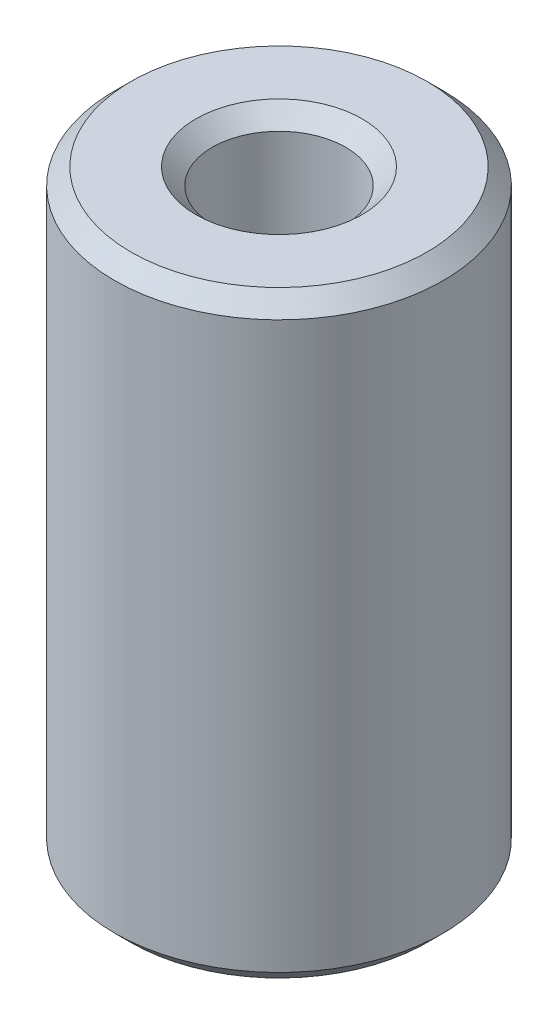
ISO-10303-21;
HEADER;
FILE_DESCRIPTION(('STEP AP214'),'2;1');
FILE_NAME('part.step','',(''),(''),'','','');
FILE_SCHEMA(('AUTOMOTIVE_DESIGN { 1 0 10303 214 1 1 1 1 }'));
ENDSEC;
DATA;
#1=APPLICATION_CONTEXT('core data for automotive mechanical design processes');
#2=APPLICATION_PROTOCOL_DEFINITION('international standard','automotive_design',2000,#1);
#3=PRODUCT_CONTEXT('',#1,'mechanical');
#4=PRODUCT('Part','Part','',(#3));
#5=PRODUCT_RELATED_PRODUCT_CATEGORY('part','',(#4));
#6=PRODUCT_DEFINITION_FORMATION('','',#4);
#7=PRODUCT_DEFINITION_CONTEXT('part definition',#1,'design');
#8=PRODUCT_DEFINITION('design','',#6,#7);
#9=PRODUCT_DEFINITION_SHAPE('','',#8);
#10=(LENGTH_UNIT() NAMED_UNIT(*) SI_UNIT(.MILLI.,.METRE.));
#11=(NAMED_UNIT(*) PLANE_ANGLE_UNIT() SI_UNIT($,.RADIAN.));
#12=(NAMED_UNIT(*) SI_UNIT($,.STERADIAN.) SOLID_ANGLE_UNIT());
#13=UNCERTAINTY_MEASURE_WITH_UNIT(LENGTH_MEASURE(1.E-05),#10,'distance_accuracy_value','');
#14=(GEOMETRIC_REPRESENTATION_CONTEXT(3) GLOBAL_UNCERTAINTY_ASSIGNED_CONTEXT((#13)) GLOBAL_UNIT_ASSIGNED_CONTEXT((#10,
#11,#12)) REPRESENTATION_CONTEXT('',''));
#15=CARTESIAN_POINT('',(0.,0.,0.));
#16=DIRECTION('',(0.,0.,1.));
#17=DIRECTION('',(1.,0.,0.));
#18=AXIS2_PLACEMENT_3D('',#15,#16,#17);
#19=CARTESIAN_POINT('',(0.,27.2912623590373,0.));
#20=DIRECTION('',(0.,-1.,0.));
#21=DIRECTION('',(0.,0.,-1.));
#22=AXIS2_PLACEMENT_3D('',#19,#20,#21);
#23=CYLINDRICAL_SURFACE('',#22,7.5);
#24=CARTESIAN_POINT('',(0.,0.748931803457614,0.));
#25=DIRECTION('',(0.,1.,0.));
#26=DIRECTION('',(0.,0.,1.));
#27=AXIS2_PLACEMENT_3D('',#24,#25,#26);
#28=CIRCLE('',#27,7.5);
#29=CARTESIAN_POINT('',(0.,0.748931803457611,-7.5));
#30=VERTEX_POINT('',#29);
#31=EDGE_CURVE('E10',#30,#30,#28,.T.);
#32=CARTESIAN_POINT('',(0.,26.5423305555798,0.));
#33=DIRECTION('',(0.,1.,0.));
#34=DIRECTION('',(0.,0.,1.));
#35=AXIS2_PLACEMENT_3D('',#32,#33,#34);
#36=CIRCLE('',#35,7.5);
#37=CARTESIAN_POINT('',(0.,26.5423305555798,-7.5));
#38=VERTEX_POINT('',#37);
#39=EDGE_CURVE('E50',#38,#38,#36,.F.);
#40=CARTESIAN_POINT('',(0.,0.748931803457611,-7.5));
#41=CARTESIAN_POINT('',(0.,1.01761304045888,-7.5));
#42=CARTESIAN_POINT('',(0.,1.28629427746016,-7.5));
#43=CARTESIAN_POINT('',(0.,1.8236567514627,-7.5));
#44=CARTESIAN_POINT('',(0.,2.09233798846397,-7.5));
#45=CARTESIAN_POINT('',(0.,2.62970046246652,-7.5));
#46=CARTESIAN_POINT('',(0.,2.89838169946779,-7.5));
#47=CARTESIAN_POINT('',(0.,3.43574417347034,-7.5));
#48=CARTESIAN_POINT('',(0.,3.70442541047161,-7.5));
#49=CARTESIAN_POINT('',(0.,4.24178788447415,-7.5));
#50=CARTESIAN_POINT('',(0.,4.51046912147542,-7.5));
#51=CARTESIAN_POINT('',(0.,5.04783159547797,-7.5));
#52=CARTESIAN_POINT('',(0.,5.31651283247924,-7.5));
#53=CARTESIAN_POINT('',(0.,5.85387530648179,-7.5));
#54=CARTESIAN_POINT('',(0.,6.12255654348306,-7.5));
#55=CARTESIAN_POINT('',(0.,6.6599190174856,-7.5));
#56=CARTESIAN_POINT('',(0.,6.92860025448687,-7.5));
#57=CARTESIAN_POINT('',(0.,7.46596272848942,-7.5));
#58=CARTESIAN_POINT('',(0.,7.73464396549069,-7.5));
#59=CARTESIAN_POINT('',(0.,8.27200643949324,-7.5));
#60=CARTESIAN_POINT('',(0.,8.54068767649451,-7.5));
#61=CARTESIAN_POINT('',(0.,9.07805015049705,-7.5));
#62=CARTESIAN_POINT('',(0.,9.34673138749833,-7.5));
#63=CARTESIAN_POINT('',(0.,9.88409386150087,-7.5));
#64=CARTESIAN_POINT('',(0.,10.1527750985021,-7.5));
#65=CARTESIAN_POINT('',(0.,10.6901375725047,-7.5));
#66=CARTESIAN_POINT('',(0.,10.958818809506,-7.5));
#67=CARTESIAN_POINT('',(0.,11.4961812835085,-7.5));
#68=CARTESIAN_POINT('',(0.,11.7648625205098,-7.5));
#69=CARTESIAN_POINT('',(0.,12.3022249945123,-7.5));
#70=CARTESIAN_POINT('',(0.,12.5709062315136,-7.5));
#71=CARTESIAN_POINT('',(0.,13.1082687055161,-7.5));
#72=CARTESIAN_POINT('',(0.,13.3769499425174,-7.5));
#73=CARTESIAN_POINT('',(0.,13.91431241652,-7.5));
#74=CARTESIAN_POINT('',(0.,14.1829936535212,-7.5));
#75=CARTESIAN_POINT('',(0.,14.7203561275238,-7.5));
#76=CARTESIAN_POINT('',(0.,14.989037364525,-7.5));
#77=CARTESIAN_POINT('',(0.,15.5263998385276,-7.5));
#78=CARTESIAN_POINT('',(0.,15.7950810755289,-7.5));
#79=CARTESIAN_POINT('',(0.,16.3324435495314,-7.5));
#80=CARTESIAN_POINT('',(0.,16.6011247865327,-7.5));
#81=CARTESIAN_POINT('',(0.,17.1384872605352,-7.5));
#82=CARTESIAN_POINT('',(0.,17.4071684975365,-7.5));
#83=CARTESIAN_POINT('',(0.,17.944530971539,-7.5));
#84=CARTESIAN_POINT('',(0.,18.2132122085403,-7.5));
#85=CARTESIAN_POINT('',(0.,18.7505746825429,-7.5));
#86=CARTESIAN_POINT('',(0.,19.0192559195441,-7.5));
#87=CARTESIAN_POINT('',(0.,19.5566183935467,-7.5));
#88=CARTESIAN_POINT('',(0.,19.8252996305479,-7.5));
#89=CARTESIAN_POINT('',(0.,20.3626621045505,-7.5));
#90=CARTESIAN_POINT('',(0.,20.6313433415518,-7.5));
#91=CARTESIAN_POINT('',(0.,21.1687058155543,-7.5));
#92=CARTESIAN_POINT('',(0.,21.4373870525556,-7.5));
#93=CARTESIAN_POINT('',(0.,21.9747495265581,-7.5));
#94=CARTESIAN_POINT('',(0.,22.2434307635594,-7.5));
#95=CARTESIAN_POINT('',(0.,22.7807932375619,-7.5));
#96=CARTESIAN_POINT('',(0.,23.0494744745632,-7.5));
#97=CARTESIAN_POINT('',(0.,23.5868369485658,-7.5));
#98=CARTESIAN_POINT('',(0.,23.855518185567,-7.5));
#99=CARTESIAN_POINT('',(0.,24.3928806595696,-7.5));
#100=CARTESIAN_POINT('',(0.,24.6615618965708,-7.5));
#101=CARTESIAN_POINT('',(0.,25.1989243705734,-7.5));
#102=CARTESIAN_POINT('',(0.,25.4676056075747,-7.5));
#103=CARTESIAN_POINT('',(0.,26.0049680815772,-7.5));
#104=CARTESIAN_POINT('',(0.,26.2736493185785,-7.5));
#105=CARTESIAN_POINT('',(0.,26.5423305555798,-7.5));
#106=B_SPLINE_CURVE_WITH_KNOTS('',3,(#40,#41,#42,#43,#44,#45,#46,#47,#48,#49,#50,#51,#52,#53,
#54,#55,#56,#57,#58,#59,#60,#61,#62,#63,#64,#65,#66,#67,#68,#69,#70,#71,#72,#73,#74,#75,#76,#77,
#78,#79,#80,#81,#82,#83,#84,#85,#86,#87,#88,#89,#90,#91,#92,#93,#94,#95,#96,#97,#98,#99,#100,
#101,#102,#103,#104,#105),.UNSPECIFIED.,.F.,.F.,(4,2,2,2,2,2,2,2,2,2,2,2,2,2,2,2,2,2,2,2,2,2,2,
2,2,2,2,2,2,2,2,2,4),(0.,0.806043711003818,1.61208742200764,2.41813113301145,3.22417484401527,
4.03021855501908,4.8362622660229,5.64230597702672,6.44834968803053,7.25439339903435,
8.06043711003817,8.86648082104199,9.67252453204581,10.4785682430496,11.2846119540534,
12.0906556650573,12.8966993760611,13.7027430870649,14.5087867980687,15.3148305090725,
16.1208742200763,16.9269179310802,17.732961642084,18.5390053530878,19.3450490640916,
20.1510927750954,20.9571364860992,21.7631801971031,22.5692239081069,23.3752676191107,
24.1813113301145,24.9873550411183,25.7933987521221),.UNSPECIFIED.);
#107=EDGE_CURVE('BSEAM39',#30,#38,#106,.T.);
#108=ORIENTED_EDGE('',*,*,#31,.T.);
#109=ORIENTED_EDGE('',*,*,#39,.T.);
#110=ORIENTED_EDGE('',*,*,#107,.T.);
#111=ORIENTED_EDGE('',*,*,#107,.F.);
#112=EDGE_LOOP('',(#108,#110,#109,#111));
#113=FACE_BOUND('',#112,.T.);
#114=ADVANCED_FACE('F39',(#113),#23,.T.);
#115=CARTESIAN_POINT('',(0.,27.2912623590373,0.));
#116=DIRECTION('',(0.,1.,0.));
#117=DIRECTION('',(0.,0.,1.));
#118=AXIS2_PLACEMENT_3D('',#115,#116,#117);
#119=PLANE('',#118);
#120=CARTESIAN_POINT('',(0.,27.2912623590373,0.));
#121=DIRECTION('',(0.,1.,0.));
#122=DIRECTION('',(0.,0.,1.));
#123=AXIS2_PLACEMENT_3D('',#120,#121,#122);
#124=CIRCLE('',#123,3.79261097689571);
#125=CARTESIAN_POINT('',(0.,27.2912623590373,3.79261097689571));
#126=VERTEX_POINT('',#125);
#127=EDGE_CURVE('E58',#126,#126,#124,.F.);
#128=ORIENTED_EDGE('',*,*,#127,.T.);
#129=EDGE_LOOP('',(#128));
#130=FACE_BOUND('',#129,.T.);
#131=CARTESIAN_POINT('',(0.,27.2912623590373,0.));
#132=DIRECTION('',(0.,1.,0.));
#133=DIRECTION('',(0.,0.,1.));
#134=AXIS2_PLACEMENT_3D('',#131,#132,#133);
#135=CIRCLE('',#134,6.75106819654243);
#136=CARTESIAN_POINT('',(0.,27.2912623590373,6.75106819654243));
#137=VERTEX_POINT('',#136);
#138=EDGE_CURVE('E61',#137,#137,#135,.T.);
#139=ORIENTED_EDGE('',*,*,#138,.T.);
#140=EDGE_LOOP('',(#139));
#141=FACE_BOUND('',#140,.T.);
#142=ADVANCED_FACE('F88',(#130,#141),#119,.T.);
#143=CARTESIAN_POINT('',(0.,0.,0.));
#144=DIRECTION('',(0.,1.,0.));
#145=DIRECTION('',(0.,0.,1.));
#146=AXIS2_PLACEMENT_3D('',#143,#144,#145);
#147=PLANE('',#146);
#148=CARTESIAN_POINT('',(0.,0.,0.));
#149=DIRECTION('',(0.,1.,0.));
#150=DIRECTION('',(0.,0.,1.));
#151=AXIS2_PLACEMENT_3D('',#148,#149,#150);
#152=CIRCLE('',#151,3.79261097689569);
#153=CARTESIAN_POINT('',(0.,0.,3.79261097689569));
#154=VERTEX_POINT('',#153);
#155=EDGE_CURVE('E51',#154,#154,#152,.T.);
#156=ORIENTED_EDGE('',*,*,#155,.T.);
#157=EDGE_LOOP('',(#156));
#158=FACE_BOUND('',#157,.T.);
#159=CARTESIAN_POINT('',(0.,0.,0.));
#160=DIRECTION('',(0.,1.,0.));
#161=DIRECTION('',(0.,0.,1.));
#162=AXIS2_PLACEMENT_3D('',#159,#160,#161);
#163=CIRCLE('',#162,6.75106819654238);
#164=CARTESIAN_POINT('',(0.,0.,6.75106819654238));
#165=VERTEX_POINT('',#164);
#166=EDGE_CURVE('E54',#165,#165,#163,.F.);
#167=ORIENTED_EDGE('',*,*,#166,.T.);
#168=EDGE_LOOP('',(#167));
#169=FACE_BOUND('',#168,.T.);
#170=ADVANCED_FACE('F83',(#158,#169),#147,.F.);
#171=CARTESIAN_POINT('',(0.,27.2912623590373,0.));
#172=DIRECTION('',(0.,-1.,0.));
#173=DIRECTION('',(0.,0.,-1.));
#174=AXIS2_PLACEMENT_3D('',#171,#172,#173);
#175=CYLINDRICAL_SURFACE('',#174,3.04367917343811);
#176=CARTESIAN_POINT('',(0.,26.5423305555797,0.));
#177=DIRECTION('',(0.,1.,0.));
#178=DIRECTION('',(0.,0.,1.));
#179=AXIS2_PLACEMENT_3D('',#176,#177,#178);
#180=CIRCLE('',#179,3.04367917343811);
#181=CARTESIAN_POINT('',(0.,26.5423305555797,-3.04367917343811));
#182=VERTEX_POINT('',#181);
#183=EDGE_CURVE('E67',#182,#182,#180,.T.);
#184=CARTESIAN_POINT('',(0.,0.748931803457586,0.));
#185=DIRECTION('',(0.,1.,0.));
#186=DIRECTION('',(0.,0.,1.));
#187=AXIS2_PLACEMENT_3D('',#184,#185,#186);
#188=CIRCLE('',#187,3.04367917343811);
#189=CARTESIAN_POINT('',(0.,0.748931803457583,-3.04367917343811));
#190=VERTEX_POINT('',#189);
#191=EDGE_CURVE('E69',#190,#190,#188,.F.);
#192=CARTESIAN_POINT('',(0.,26.5423305555797,-3.04367917343811));
#193=CARTESIAN_POINT('',(0.,26.2736493185785,-3.04367917343811));
#194=CARTESIAN_POINT('',(0.,26.0049680815772,-3.04367917343811));
#195=CARTESIAN_POINT('',(0.,25.4676056075746,-3.04367917343811));
#196=CARTESIAN_POINT('',(0.,25.1989243705734,-3.04367917343811));
#197=CARTESIAN_POINT('',(0.,24.6615618965708,-3.04367917343811));
#198=CARTESIAN_POINT('',(0.,24.3928806595695,-3.04367917343811));
#199=CARTESIAN_POINT('',(0.,23.855518185567,-3.04367917343811));
#200=CARTESIAN_POINT('',(0.,23.5868369485657,-3.04367917343811));
#201=CARTESIAN_POINT('',(0.,23.0494744745632,-3.04367917343811));
#202=CARTESIAN_POINT('',(0.,22.7807932375619,-3.04367917343811));
#203=CARTESIAN_POINT('',(0.,22.2434307635594,-3.04367917343811));
#204=CARTESIAN_POINT('',(0.,21.9747495265581,-3.04367917343811));
#205=CARTESIAN_POINT('',(0.,21.4373870525556,-3.04367917343811));
#206=CARTESIAN_POINT('',(0.,21.1687058155543,-3.04367917343811));
#207=CARTESIAN_POINT('',(0.,20.6313433415517,-3.04367917343811));
#208=CARTESIAN_POINT('',(0.,20.3626621045505,-3.04367917343811));
#209=CARTESIAN_POINT('',(0.,19.8252996305479,-3.04367917343811));
#210=CARTESIAN_POINT('',(0.,19.5566183935466,-3.04367917343811));
#211=CARTESIAN_POINT('',(0.,19.0192559195441,-3.04367917343811));
#212=CARTESIAN_POINT('',(0.,18.7505746825428,-3.04367917343811));
#213=CARTESIAN_POINT('',(0.,18.2132122085403,-3.04367917343811));
#214=CARTESIAN_POINT('',(0.,17.944530971539,-3.04367917343811));
#215=CARTESIAN_POINT('',(0.,17.4071684975365,-3.04367917343811));
#216=CARTESIAN_POINT('',(0.,17.1384872605352,-3.04367917343811));
#217=CARTESIAN_POINT('',(0.,16.6011247865327,-3.04367917343811));
#218=CARTESIAN_POINT('',(0.,16.3324435495314,-3.04367917343811));
#219=CARTESIAN_POINT('',(0.,15.7950810755288,-3.04367917343811));
#220=CARTESIAN_POINT('',(0.,15.5263998385276,-3.04367917343811));
#221=CARTESIAN_POINT('',(0.,14.989037364525,-3.04367917343811));
#222=CARTESIAN_POINT('',(0.,14.7203561275237,-3.04367917343811));
#223=CARTESIAN_POINT('',(0.,14.1829936535212,-3.04367917343811));
#224=CARTESIAN_POINT('',(0.,13.9143124165199,-3.04367917343811));
#225=CARTESIAN_POINT('',(0.,13.3769499425174,-3.04367917343811));
#226=CARTESIAN_POINT('',(0.,13.1082687055161,-3.04367917343811));
#227=CARTESIAN_POINT('',(0.,12.5709062315136,-3.04367917343811));
#228=CARTESIAN_POINT('',(0.,12.3022249945123,-3.04367917343811));
#229=CARTESIAN_POINT('',(0.,11.7648625205097,-3.04367917343811));
#230=CARTESIAN_POINT('',(0.,11.4961812835085,-3.04367917343811));
#231=CARTESIAN_POINT('',(0.,10.9588188095059,-3.04367917343811));
#232=CARTESIAN_POINT('',(0.,10.6901375725047,-3.04367917343811));
#233=CARTESIAN_POINT('',(0.,10.1527750985021,-3.04367917343811));
#234=CARTESIAN_POINT('',(0.,9.88409386150084,-3.04367917343811));
#235=CARTESIAN_POINT('',(0.,9.3467313874983,-3.04367917343811));
#236=CARTESIAN_POINT('',(0.,9.07805015049703,-3.04367917343811));
#237=CARTESIAN_POINT('',(0.,8.54068767649448,-3.04367917343811));
#238=CARTESIAN_POINT('',(0.,8.27200643949321,-3.04367917343811));
#239=CARTESIAN_POINT('',(0.,7.73464396549066,-3.04367917343811));
#240=CARTESIAN_POINT('',(0.,7.46596272848939,-3.04367917343811));
#241=CARTESIAN_POINT('',(0.,6.92860025448685,-3.04367917343811));
#242=CARTESIAN_POINT('',(0.,6.65991901748558,-3.04367917343811));
#243=CARTESIAN_POINT('',(0.,6.12255654348303,-3.04367917343811));
#244=CARTESIAN_POINT('',(0.,5.85387530648176,-3.04367917343811));
#245=CARTESIAN_POINT('',(0.,5.31651283247922,-3.04367917343811));
#246=CARTESIAN_POINT('',(0.,5.04783159547794,-3.04367917343811));
#247=CARTESIAN_POINT('',(0.,4.5104691214754,-3.04367917343811));
#248=CARTESIAN_POINT('',(0.,4.24178788447413,-3.04367917343811));
#249=CARTESIAN_POINT('',(0.,3.70442541047158,-3.04367917343811));
#250=CARTESIAN_POINT('',(0.,3.43574417347031,-3.04367917343811));
#251=CARTESIAN_POINT('',(0.,2.89838169946776,-3.04367917343811));
#252=CARTESIAN_POINT('',(0.,2.62970046246649,-3.04367917343811));
#253=CARTESIAN_POINT('',(0.,2.09233798846395,-3.04367917343811));
#254=CARTESIAN_POINT('',(0.,1.82365675146267,-3.04367917343811));
#255=CARTESIAN_POINT('',(0.,1.28629427746013,-3.04367917343811));
#256=CARTESIAN_POINT('',(0.,1.01761304045886,-3.04367917343811));
#257=CARTESIAN_POINT('',(0.,0.748931803457583,-3.04367917343811));
#258=B_SPLINE_CURVE_WITH_KNOTS('',3,(#192,#193,#194,#195,#196,#197,#198,#199,#200,#201,#202,
#203,#204,#205,#206,#207,#208,#209,#210,#211,#212,#213,#214,#215,#216,#217,#218,#219,#220,#221,
#222,#223,#224,#225,#226,#227,#228,#229,#230,#231,#232,#233,#234,#235,#236,#237,#238,#239,#240,
#241,#242,#243,#244,#245,#246,#247,#248,#249,#250,#251,#252,#253,#254,#255,#256,#257),
.UNSPECIFIED.,.F.,.F.,(4,2,2,2,2,2,2,2,2,2,2,2,2,2,2,2,2,2,2,2,2,2,2,2,2,2,2,2,2,2,2,2,4),(0.,
0.806043711003818,1.61208742200764,2.41813113301145,3.22417484401527,4.03021855501908,
4.8362622660229,5.64230597702672,6.44834968803054,7.25439339903436,8.06043711003817,
8.86648082104199,9.67252453204581,10.4785682430496,11.2846119540534,12.0906556650573,
12.8966993760611,13.7027430870649,14.5087867980687,15.3148305090725,16.1208742200763,
16.9269179310802,17.732961642084,18.5390053530878,19.3450490640916,20.1510927750954,
20.9571364860992,21.7631801971031,22.5692239081069,23.3752676191107,24.1813113301145,
24.9873550411183,25.7933987521221),.UNSPECIFIED.);
#259=EDGE_CURVE('BSEAM71',#182,#190,#258,.T.);
#260=ORIENTED_EDGE('',*,*,#183,.T.);
#261=ORIENTED_EDGE('',*,*,#191,.T.);
#262=ORIENTED_EDGE('',*,*,#259,.T.);
#263=ORIENTED_EDGE('',*,*,#259,.F.);
#264=EDGE_LOOP('',(#260,#262,#261,#263));
#265=FACE_BOUND('',#264,.T.);
#266=ADVANCED_FACE('F71',(#265),#175,.F.);
#267=CARTESIAN_POINT('',(0.,26.5423305555797,0.));
#268=DIRECTION('',(0.,1.,0.));
#269=DIRECTION('',(0.,0.,1.));
#270=AXIS2_PLACEMENT_3D('',#267,#268,#269);
#271=CONICAL_SURFACE('',#270,3.04367917343811,0.785398163397453);
#272=ORIENTED_EDGE('',*,*,#127,.F.);
#273=EDGE_LOOP('',(#272));
#274=FACE_BOUND('',#273,.T.);
#275=ORIENTED_EDGE('',*,*,#183,.F.);
#276=EDGE_LOOP('',(#275));
#277=FACE_BOUND('',#276,.T.);
#278=ADVANCED_FACE('F77',(#274,#277),#271,.F.);
#279=CARTESIAN_POINT('',(0.,0.,0.));
#280=DIRECTION('',(0.,-1.,0.));
#281=DIRECTION('',(0.,0.,-1.));
#282=AXIS2_PLACEMENT_3D('',#279,#280,#281);
#283=CONICAL_SURFACE('',#282,3.79261097689569,0.785398163397444);
#284=ORIENTED_EDGE('',*,*,#191,.F.);
#285=EDGE_LOOP('',(#284));
#286=FACE_BOUND('',#285,.T.);
#287=ORIENTED_EDGE('',*,*,#155,.F.);
#288=EDGE_LOOP('',(#287));
#289=FACE_BOUND('',#288,.T.);
#290=ADVANCED_FACE('F73',(#286,#289),#283,.F.);
#291=CARTESIAN_POINT('',(0.,0.748931803457614,0.));
#292=DIRECTION('',(0.,1.,0.));
#293=DIRECTION('',(0.,0.,1.));
#294=AXIS2_PLACEMENT_3D('',#291,#292,#293);
#295=CONICAL_SURFACE('',#294,7.5,0.785398163397452);
#296=ORIENTED_EDGE('',*,*,#166,.F.);
#297=EDGE_LOOP('',(#296));
#298=FACE_BOUND('',#297,.T.);
#299=ORIENTED_EDGE('',*,*,#31,.F.);
#300=EDGE_LOOP('',(#299));
#301=FACE_BOUND('',#300,.T.);
#302=ADVANCED_FACE('F76',(#298,#301),#295,.T.);
#303=CARTESIAN_POINT('',(0.,27.2912623590373,0.));
#304=DIRECTION('',(0.,-1.,0.));
#305=DIRECTION('',(0.,0.,-1.));
#306=AXIS2_PLACEMENT_3D('',#303,#304,#305);
#307=CONICAL_SURFACE('',#306,6.75106819654243,0.785398163397447);
#308=ORIENTED_EDGE('',*,*,#39,.F.);
#309=EDGE_LOOP('',(#308));
#310=FACE_BOUND('',#309,.T.);
#311=ORIENTED_EDGE('',*,*,#138,.F.);
#312=EDGE_LOOP('',(#311));
#313=FACE_BOUND('',#312,.T.);
#314=ADVANCED_FACE('F45',(#310,#313),#307,.T.);
#315=CLOSED_SHELL('',(#114,#142,#170,#266,#278,#290,#302,#314));
#316=MANIFOLD_SOLID_BREP('B2',#315);
#317=ADVANCED_BREP_SHAPE_REPRESENTATION('',(#18,#316),#14);
#318=SHAPE_DEFINITION_REPRESENTATION(#9,#317);
ENDSEC;
END-ISO-10303-21;
